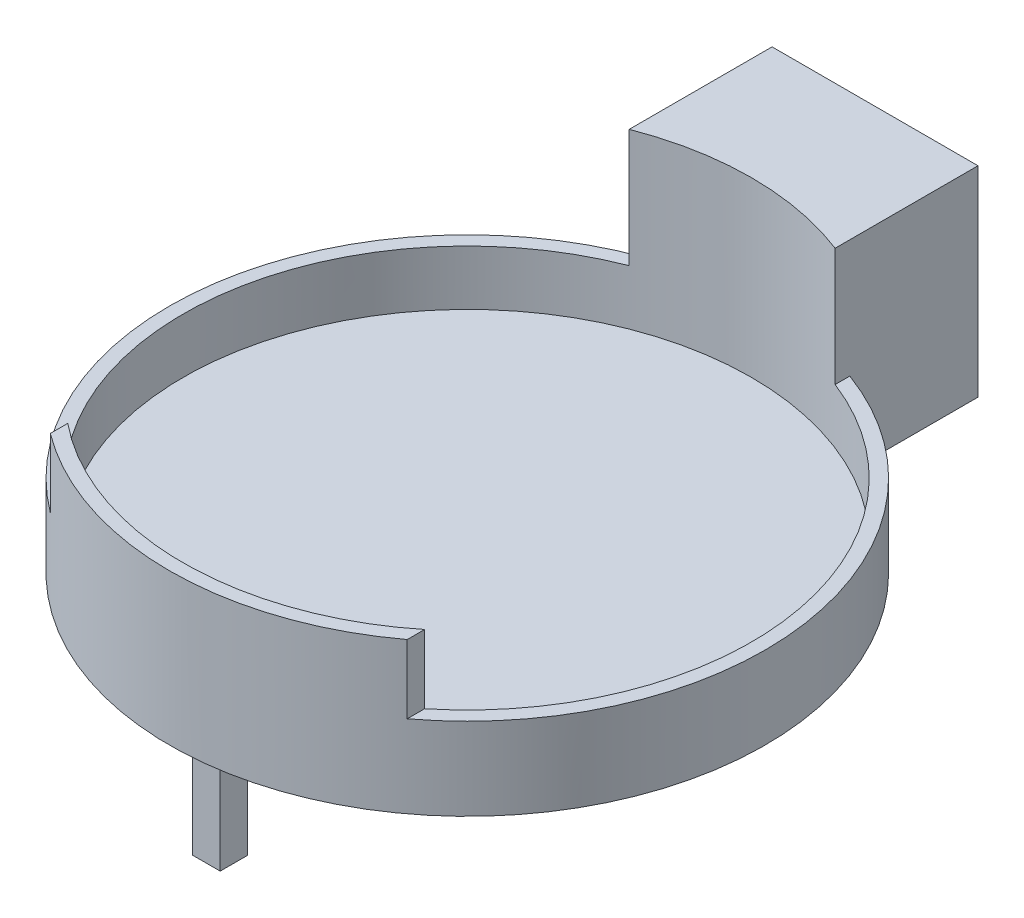
ISO-10303-21;
HEADER;
FILE_DESCRIPTION(('STEP AP214'),'2;1');
FILE_NAME('part.step','',(''),(''),'','','');
FILE_SCHEMA(('AUTOMOTIVE_DESIGN { 1 0 10303 214 1 1 1 1 }'));
ENDSEC;
DATA;
#1=APPLICATION_CONTEXT('core data for automotive mechanical design processes');
#2=APPLICATION_PROTOCOL_DEFINITION('international standard','automotive_design',2000,#1);
#3=PRODUCT_CONTEXT('',#1,'mechanical');
#4=PRODUCT('Part','Part','',(#3));
#5=PRODUCT_RELATED_PRODUCT_CATEGORY('part','',(#4));
#6=PRODUCT_DEFINITION_FORMATION('','',#4);
#7=PRODUCT_DEFINITION_CONTEXT('part definition',#1,'design');
#8=PRODUCT_DEFINITION('design','',#6,#7);
#9=PRODUCT_DEFINITION_SHAPE('','',#8);
#10=(LENGTH_UNIT() NAMED_UNIT(*) SI_UNIT(.MILLI.,.METRE.));
#11=(NAMED_UNIT(*) PLANE_ANGLE_UNIT() SI_UNIT($,.RADIAN.));
#12=(NAMED_UNIT(*) SI_UNIT($,.STERADIAN.) SOLID_ANGLE_UNIT());
#13=UNCERTAINTY_MEASURE_WITH_UNIT(LENGTH_MEASURE(1.E-05),#10,'distance_accuracy_value','');
#14=(GEOMETRIC_REPRESENTATION_CONTEXT(3) GLOBAL_UNCERTAINTY_ASSIGNED_CONTEXT((#13)) GLOBAL_UNIT_ASSIGNED_CONTEXT((#10,
#11,#12)) REPRESENTATION_CONTEXT('',''));
#15=CARTESIAN_POINT('',(0.,0.,0.));
#16=DIRECTION('',(0.,0.,1.));
#17=DIRECTION('',(1.,0.,0.));
#18=AXIS2_PLACEMENT_3D('',#15,#16,#17);
#19=CARTESIAN_POINT('',(0.,0.,0.));
#20=DIRECTION('',(0.,1.,0.));
#21=DIRECTION('',(0.,0.,1.));
#22=AXIS2_PLACEMENT_3D('',#19,#20,#21);
#23=PLANE('',#22);
#24=DIRECTION('',(0.,0.,-1.));
#25=VECTOR('',#24,1.);
#26=CARTESIAN_POINT('',(-0.5,0.,8.5));
#27=LINE('',#26,#25);
#28=CARTESIAN_POINT('',(-0.5,0.,9.5));
#29=VERTEX_POINT('',#28);
#30=CARTESIAN_POINT('',(-0.5,0.,8.5));
#31=VERTEX_POINT('',#30);
#32=EDGE_CURVE('E283',#29,#31,#27,.T.);
#33=ORIENTED_EDGE('',*,*,#32,.F.);
#34=DIRECTION('',(-1.,0.,0.));
#35=VECTOR('',#34,1.);
#36=CARTESIAN_POINT('',(0.5,0.,9.5));
#37=LINE('',#36,#35);
#38=CARTESIAN_POINT('',(0.5,0.,9.5));
#39=VERTEX_POINT('',#38);
#40=EDGE_CURVE('E288',#39,#29,#37,.T.);
#41=ORIENTED_EDGE('',*,*,#40,.F.);
#42=DIRECTION('',(0.,0.,1.));
#43=VECTOR('',#42,1.);
#44=CARTESIAN_POINT('',(0.5,0.,8.5));
#45=LINE('',#44,#43);
#46=CARTESIAN_POINT('',(0.5,0.,8.5));
#47=VERTEX_POINT('',#46);
#48=EDGE_CURVE('E300',#47,#39,#45,.T.);
#49=ORIENTED_EDGE('',*,*,#48,.F.);
#50=DIRECTION('',(1.,0.,0.));
#51=VECTOR('',#50,1.);
#52=CARTESIAN_POINT('',(0.5,0.,8.5));
#53=LINE('',#52,#51);
#54=EDGE_CURVE('E297',#31,#47,#53,.T.);
#55=ORIENTED_EDGE('',*,*,#54,.F.);
#56=EDGE_LOOP('',(#33,#41,#49,#55));
#57=FACE_BOUND('',#56,.T.);
#58=CARTESIAN_POINT('',(0.,0.,0.));
#59=DIRECTION('',(0.,1.,0.));
#60=DIRECTION('',(0.,0.,1.));
#61=AXIS2_PLACEMENT_3D('',#58,#59,#60);
#62=CIRCLE('',#61,10.85);
#63=CARTESIAN_POINT('',(-3.75,0.,-10.1813555089683));
#64=VERTEX_POINT('',#63);
#65=CARTESIAN_POINT('',(3.75,0.,-10.1813555089683));
#66=VERTEX_POINT('',#65);
#67=EDGE_CURVE('E70',#64,#66,#62,.T.);
#68=ORIENTED_EDGE('',*,*,#67,.F.);
#69=DIRECTION('',(0.,0.,-1.));
#70=VECTOR('',#69,1.);
#71=CARTESIAN_POINT('',(-3.75,0.,-10.1813555089683));
#72=LINE('',#71,#70);
#73=CARTESIAN_POINT('',(-3.75,0.,-14.85));
#74=VERTEX_POINT('',#73);
#75=EDGE_CURVE('E341',#64,#74,#72,.T.);
#76=ORIENTED_EDGE('',*,*,#75,.T.);
#77=DIRECTION('',(1.,0.,0.));
#78=VECTOR('',#77,1.);
#79=CARTESIAN_POINT('',(-3.75,0.,-14.85));
#80=LINE('',#79,#78);
#81=CARTESIAN_POINT('',(3.75,0.,-14.85));
#82=VERTEX_POINT('',#81);
#83=EDGE_CURVE('E197',#74,#82,#80,.T.);
#84=ORIENTED_EDGE('',*,*,#83,.T.);
#85=DIRECTION('',(0.,0.,1.));
#86=VECTOR('',#85,1.);
#87=CARTESIAN_POINT('',(3.75,0.,-14.85));
#88=LINE('',#87,#86);
#89=EDGE_CURVE('E199',#82,#66,#88,.T.);
#90=ORIENTED_EDGE('',*,*,#89,.T.);
#91=EDGE_LOOP('',(#68,#76,#84,#90));
#92=FACE_BOUND('',#91,.T.);
#93=DIRECTION('',(0.,0.,1.));
#94=VECTOR('',#93,1.);
#95=CARTESIAN_POINT('',(0.5,0.,-8.5));
#96=LINE('',#95,#94);
#97=CARTESIAN_POINT('',(0.5,0.,-9.5));
#98=VERTEX_POINT('',#97);
#99=CARTESIAN_POINT('',(0.5,0.,-8.5));
#100=VERTEX_POINT('',#99);
#101=EDGE_CURVE('E250',#98,#100,#96,.T.);
#102=ORIENTED_EDGE('',*,*,#101,.F.);
#103=DIRECTION('',(1.,0.,0.));
#104=VECTOR('',#103,1.);
#105=CARTESIAN_POINT('',(-0.5,0.,-9.5));
#106=LINE('',#105,#104);
#107=CARTESIAN_POINT('',(-0.5,0.,-9.5));
#108=VERTEX_POINT('',#107);
#109=EDGE_CURVE('E255',#108,#98,#106,.T.);
#110=ORIENTED_EDGE('',*,*,#109,.F.);
#111=DIRECTION('',(0.,0.,-1.));
#112=VECTOR('',#111,1.);
#113=CARTESIAN_POINT('',(-0.5,0.,-8.5));
#114=LINE('',#113,#112);
#115=CARTESIAN_POINT('',(-0.5,0.,-8.5));
#116=VERTEX_POINT('',#115);
#117=EDGE_CURVE('E267',#116,#108,#114,.T.);
#118=ORIENTED_EDGE('',*,*,#117,.F.);
#119=DIRECTION('',(-1.,0.,0.));
#120=VECTOR('',#119,1.);
#121=CARTESIAN_POINT('',(-0.5,0.,-8.5));
#122=LINE('',#121,#120);
#123=EDGE_CURVE('E264',#100,#116,#122,.T.);
#124=ORIENTED_EDGE('',*,*,#123,.F.);
#125=EDGE_LOOP('',(#102,#110,#118,#124));
#126=FACE_BOUND('',#125,.T.);
#127=ADVANCED_FACE('F51',(#57,#92,#126),#23,.F.);
#128=CARTESIAN_POINT('',(0.,1.,0.));
#129=DIRECTION('',(0.,-1.,0.));
#130=DIRECTION('',(0.,0.,-1.));
#131=AXIS2_PLACEMENT_3D('',#128,#129,#130);
#132=CYLINDRICAL_SURFACE('',#131,10.85);
#133=CARTESIAN_POINT('',(0.,3.,0.));
#134=DIRECTION('',(0.,1.,0.));
#135=DIRECTION('',(0.,0.,1.));
#136=AXIS2_PLACEMENT_3D('',#133,#134,#135);
#137=CIRCLE('',#136,10.85);
#138=CARTESIAN_POINT('',(-6.5,3.,8.68749100718959));
#139=VERTEX_POINT('',#138);
#140=CARTESIAN_POINT('',(-3.75,3.,-10.1813555089683));
#141=VERTEX_POINT('',#140);
#142=EDGE_CURVE('E215',#139,#141,#137,.F.);
#143=ORIENTED_EDGE('',*,*,#142,.T.);
#144=DIRECTION('',(0.,-1.,0.));
#145=VECTOR('',#144,1.);
#146=CARTESIAN_POINT('',(-3.75,16.1343783812807,-10.1813555089683));
#147=LINE('',#146,#145);
#148=EDGE_CURVE('E66',#141,#64,#147,.T.);
#149=ORIENTED_EDGE('',*,*,#148,.T.);
#150=ORIENTED_EDGE('',*,*,#67,.T.);
#151=DIRECTION('',(0.,-1.,0.));
#152=VECTOR('',#151,1.);
#153=CARTESIAN_POINT('',(3.75,16.1343783812807,-10.1813555089683));
#154=LINE('',#153,#152);
#155=CARTESIAN_POINT('',(3.75,3.,-10.1813555089683));
#156=VERTEX_POINT('',#155);
#157=EDGE_CURVE('E208',#156,#66,#154,.T.);
#158=ORIENTED_EDGE('',*,*,#157,.F.);
#159=CARTESIAN_POINT('',(0.,3.,0.));
#160=DIRECTION('',(0.,1.,0.));
#161=DIRECTION('',(0.,0.,1.));
#162=AXIS2_PLACEMENT_3D('',#159,#160,#161);
#163=CIRCLE('',#162,10.85);
#164=CARTESIAN_POINT('',(6.5,3.,8.68749100718959));
#165=VERTEX_POINT('',#164);
#166=EDGE_CURVE('E229',#156,#165,#163,.F.);
#167=ORIENTED_EDGE('',*,*,#166,.T.);
#168=DIRECTION('',(0.,1.,0.));
#169=VECTOR('',#168,1.);
#170=CARTESIAN_POINT('',(6.5,-19.1604406908759,8.68749100718959));
#171=LINE('',#170,#169);
#172=CARTESIAN_POINT('',(6.5,5.5,8.68749100718959));
#173=VERTEX_POINT('',#172);
#174=EDGE_CURVE('E226',#165,#173,#171,.T.);
#175=ORIENTED_EDGE('',*,*,#174,.T.);
#176=CARTESIAN_POINT('',(0.,5.5,0.));
#177=DIRECTION('',(0.,1.,0.));
#178=DIRECTION('',(0.,0.,1.));
#179=AXIS2_PLACEMENT_3D('',#176,#177,#178);
#180=CIRCLE('',#179,10.85);
#181=CARTESIAN_POINT('',(-6.5,5.5,8.68749100718959));
#182=VERTEX_POINT('',#181);
#183=EDGE_CURVE('E237',#173,#182,#180,.F.);
#184=ORIENTED_EDGE('',*,*,#183,.T.);
#185=DIRECTION('',(0.,1.,0.));
#186=VECTOR('',#185,1.);
#187=CARTESIAN_POINT('',(-6.5,-19.1604406908759,8.68749100718959));
#188=LINE('',#187,#186);
#189=EDGE_CURVE('E219',#139,#182,#188,.T.);
#190=ORIENTED_EDGE('',*,*,#189,.F.);
#191=EDGE_LOOP('',(#143,#149,#150,#158,#167,#175,#184,#190));
#192=FACE_BOUND('',#191,.T.);
#193=ADVANCED_FACE('F53',(#192),#132,.T.);
#194=CARTESIAN_POINT('',(-0.5,-4.4,8.5));
#195=DIRECTION('',(1.,0.,0.));
#196=DIRECTION('',(0.,0.,-1.));
#197=AXIS2_PLACEMENT_3D('',#194,#195,#196);
#198=PLANE('',#197);
#199=ORIENTED_EDGE('',*,*,#32,.T.);
#200=DIRECTION('',(0.,1.,0.));
#201=VECTOR('',#200,1.);
#202=CARTESIAN_POINT('',(-0.5,-4.4,8.5));
#203=LINE('',#202,#201);
#204=CARTESIAN_POINT('',(-0.5,-4.4,8.5));
#205=VERTEX_POINT('',#204);
#206=EDGE_CURVE('E313',#205,#31,#203,.T.);
#207=ORIENTED_EDGE('',*,*,#206,.F.);
#208=DIRECTION('',(0.,0.,-1.));
#209=VECTOR('',#208,1.);
#210=CARTESIAN_POINT('',(-0.5,-4.4,8.5));
#211=LINE('',#210,#209);
#212=CARTESIAN_POINT('',(-0.5,-4.4,9.5));
#213=VERTEX_POINT('',#212);
#214=EDGE_CURVE('E284',#213,#205,#211,.T.);
#215=ORIENTED_EDGE('',*,*,#214,.F.);
#216=DIRECTION('',(0.,1.,0.));
#217=VECTOR('',#216,1.);
#218=CARTESIAN_POINT('',(-0.5,-4.4,9.5));
#219=LINE('',#218,#217);
#220=EDGE_CURVE('E294',#213,#29,#219,.T.);
#221=ORIENTED_EDGE('',*,*,#220,.T.);
#222=EDGE_LOOP('',(#199,#207,#215,#221));
#223=FACE_BOUND('',#222,.T.);
#224=ADVANCED_FACE('F366',(#223),#198,.F.);
#225=CARTESIAN_POINT('',(0.5,-4.4,8.5));
#226=DIRECTION('',(0.,0.,1.));
#227=DIRECTION('',(1.,0.,0.));
#228=AXIS2_PLACEMENT_3D('',#225,#226,#227);
#229=PLANE('',#228);
#230=ORIENTED_EDGE('',*,*,#54,.T.);
#231=DIRECTION('',(0.,1.,0.));
#232=VECTOR('',#231,1.);
#233=CARTESIAN_POINT('',(0.5,-4.4,8.5));
#234=LINE('',#233,#232);
#235=CARTESIAN_POINT('',(0.5,-4.4,8.5));
#236=VERTEX_POINT('',#235);
#237=EDGE_CURVE('E310',#236,#47,#234,.T.);
#238=ORIENTED_EDGE('',*,*,#237,.F.);
#239=DIRECTION('',(1.,0.,0.));
#240=VECTOR('',#239,1.);
#241=CARTESIAN_POINT('',(0.5,-4.4,8.5));
#242=LINE('',#241,#240);
#243=EDGE_CURVE('E287',#205,#236,#242,.T.);
#244=ORIENTED_EDGE('',*,*,#243,.F.);
#245=ORIENTED_EDGE('',*,*,#206,.T.);
#246=EDGE_LOOP('',(#230,#238,#244,#245));
#247=FACE_BOUND('',#246,.T.);
#248=ADVANCED_FACE('F370',(#247),#229,.F.);
#249=CARTESIAN_POINT('',(0.5,-4.4,8.5));
#250=DIRECTION('',(-1.,0.,0.));
#251=DIRECTION('',(0.,0.,1.));
#252=AXIS2_PLACEMENT_3D('',#249,#250,#251);
#253=PLANE('',#252);
#254=ORIENTED_EDGE('',*,*,#48,.T.);
#255=DIRECTION('',(0.,1.,0.));
#256=VECTOR('',#255,1.);
#257=CARTESIAN_POINT('',(0.5,-4.4,9.5));
#258=LINE('',#257,#256);
#259=CARTESIAN_POINT('',(0.5,-4.4,9.5));
#260=VERTEX_POINT('',#259);
#261=EDGE_CURVE('E307',#260,#39,#258,.T.);
#262=ORIENTED_EDGE('',*,*,#261,.F.);
#263=DIRECTION('',(0.,0.,1.));
#264=VECTOR('',#263,1.);
#265=CARTESIAN_POINT('',(0.5,-4.4,8.5));
#266=LINE('',#265,#264);
#267=EDGE_CURVE('E290',#236,#260,#266,.T.);
#268=ORIENTED_EDGE('',*,*,#267,.F.);
#269=ORIENTED_EDGE('',*,*,#237,.T.);
#270=EDGE_LOOP('',(#254,#262,#268,#269));
#271=FACE_BOUND('',#270,.T.);
#272=ADVANCED_FACE('F374',(#271),#253,.F.);
#273=CARTESIAN_POINT('',(0.5,-4.4,9.5));
#274=DIRECTION('',(0.,0.,-1.));
#275=DIRECTION('',(-1.,0.,0.));
#276=AXIS2_PLACEMENT_3D('',#273,#274,#275);
#277=PLANE('',#276);
#278=ORIENTED_EDGE('',*,*,#40,.T.);
#279=ORIENTED_EDGE('',*,*,#220,.F.);
#280=DIRECTION('',(-1.,0.,0.));
#281=VECTOR('',#280,1.);
#282=CARTESIAN_POINT('',(0.5,-4.4,9.5));
#283=LINE('',#282,#281);
#284=EDGE_CURVE('E292',#260,#213,#283,.T.);
#285=ORIENTED_EDGE('',*,*,#284,.F.);
#286=ORIENTED_EDGE('',*,*,#261,.T.);
#287=EDGE_LOOP('',(#278,#279,#285,#286));
#288=FACE_BOUND('',#287,.T.);
#289=ADVANCED_FACE('F378',(#288),#277,.F.);
#290=CARTESIAN_POINT('',(0.,-4.4,0.));
#291=DIRECTION('',(0.,-1.,0.));
#292=DIRECTION('',(0.,0.,-1.));
#293=AXIS2_PLACEMENT_3D('',#290,#291,#292);
#294=PLANE('',#293);
#295=ORIENTED_EDGE('',*,*,#214,.T.);
#296=ORIENTED_EDGE('',*,*,#243,.T.);
#297=ORIENTED_EDGE('',*,*,#267,.T.);
#298=ORIENTED_EDGE('',*,*,#284,.T.);
#299=EDGE_LOOP('',(#295,#296,#297,#298));
#300=FACE_BOUND('',#299,.T.);
#301=ADVANCED_FACE('F382',(#300),#294,.T.);
#302=CARTESIAN_POINT('',(0.5,-4.4,-8.5));
#303=DIRECTION('',(-1.,0.,0.));
#304=DIRECTION('',(0.,0.,1.));
#305=AXIS2_PLACEMENT_3D('',#302,#303,#304);
#306=PLANE('',#305);
#307=ORIENTED_EDGE('',*,*,#101,.T.);
#308=DIRECTION('',(0.,1.,0.));
#309=VECTOR('',#308,1.);
#310=CARTESIAN_POINT('',(0.5,-4.4,-8.5));
#311=LINE('',#310,#309);
#312=CARTESIAN_POINT('',(0.5,-4.4,-8.5));
#313=VERTEX_POINT('',#312);
#314=EDGE_CURVE('E280',#313,#100,#311,.T.);
#315=ORIENTED_EDGE('',*,*,#314,.F.);
#316=DIRECTION('',(0.,0.,1.));
#317=VECTOR('',#316,1.);
#318=CARTESIAN_POINT('',(0.5,-4.4,-8.5));
#319=LINE('',#318,#317);
#320=CARTESIAN_POINT('',(0.5,-4.4,-9.5));
#321=VERTEX_POINT('',#320);
#322=EDGE_CURVE('E251',#321,#313,#319,.T.);
#323=ORIENTED_EDGE('',*,*,#322,.F.);
#324=DIRECTION('',(0.,1.,0.));
#325=VECTOR('',#324,1.);
#326=CARTESIAN_POINT('',(0.5,-4.4,-9.5));
#327=LINE('',#326,#325);
#328=EDGE_CURVE('E261',#321,#98,#327,.T.);
#329=ORIENTED_EDGE('',*,*,#328,.T.);
#330=EDGE_LOOP('',(#307,#315,#323,#329));
#331=FACE_BOUND('',#330,.T.);
#332=ADVANCED_FACE('F386',(#331),#306,.F.);
#333=CARTESIAN_POINT('',(-0.5,-4.4,-8.5));
#334=DIRECTION('',(0.,0.,-1.));
#335=DIRECTION('',(-1.,0.,0.));
#336=AXIS2_PLACEMENT_3D('',#333,#334,#335);
#337=PLANE('',#336);
#338=ORIENTED_EDGE('',*,*,#123,.T.);
#339=DIRECTION('',(0.,1.,0.));
#340=VECTOR('',#339,1.);
#341=CARTESIAN_POINT('',(-0.5,-4.4,-8.5));
#342=LINE('',#341,#340);
#343=CARTESIAN_POINT('',(-0.5,-4.4,-8.5));
#344=VERTEX_POINT('',#343);
#345=EDGE_CURVE('E277',#344,#116,#342,.T.);
#346=ORIENTED_EDGE('',*,*,#345,.F.);
#347=DIRECTION('',(-1.,0.,0.));
#348=VECTOR('',#347,1.);
#349=CARTESIAN_POINT('',(-0.5,-4.4,-8.5));
#350=LINE('',#349,#348);
#351=EDGE_CURVE('E254',#313,#344,#350,.T.);
#352=ORIENTED_EDGE('',*,*,#351,.F.);
#353=ORIENTED_EDGE('',*,*,#314,.T.);
#354=EDGE_LOOP('',(#338,#346,#352,#353));
#355=FACE_BOUND('',#354,.T.);
#356=ADVANCED_FACE('F390',(#355),#337,.F.);
#357=CARTESIAN_POINT('',(-0.5,-4.4,-8.5));
#358=DIRECTION('',(1.,0.,0.));
#359=DIRECTION('',(0.,0.,-1.));
#360=AXIS2_PLACEMENT_3D('',#357,#358,#359);
#361=PLANE('',#360);
#362=ORIENTED_EDGE('',*,*,#117,.T.);
#363=DIRECTION('',(0.,1.,0.));
#364=VECTOR('',#363,1.);
#365=CARTESIAN_POINT('',(-0.5,-4.4,-9.5));
#366=LINE('',#365,#364);
#367=CARTESIAN_POINT('',(-0.5,-4.4,-9.5));
#368=VERTEX_POINT('',#367);
#369=EDGE_CURVE('E274',#368,#108,#366,.T.);
#370=ORIENTED_EDGE('',*,*,#369,.F.);
#371=DIRECTION('',(0.,0.,-1.));
#372=VECTOR('',#371,1.);
#373=CARTESIAN_POINT('',(-0.5,-4.4,-8.5));
#374=LINE('',#373,#372);
#375=EDGE_CURVE('E257',#344,#368,#374,.T.);
#376=ORIENTED_EDGE('',*,*,#375,.F.);
#377=ORIENTED_EDGE('',*,*,#345,.T.);
#378=EDGE_LOOP('',(#362,#370,#376,#377));
#379=FACE_BOUND('',#378,.T.);
#380=ADVANCED_FACE('F394',(#379),#361,.F.);
#381=CARTESIAN_POINT('',(-0.5,-4.4,-9.5));
#382=DIRECTION('',(0.,0.,1.));
#383=DIRECTION('',(1.,0.,0.));
#384=AXIS2_PLACEMENT_3D('',#381,#382,#383);
#385=PLANE('',#384);
#386=ORIENTED_EDGE('',*,*,#109,.T.);
#387=ORIENTED_EDGE('',*,*,#328,.F.);
#388=DIRECTION('',(1.,0.,0.));
#389=VECTOR('',#388,1.);
#390=CARTESIAN_POINT('',(-0.5,-4.4,-9.5));
#391=LINE('',#390,#389);
#392=EDGE_CURVE('E259',#368,#321,#391,.T.);
#393=ORIENTED_EDGE('',*,*,#392,.F.);
#394=ORIENTED_EDGE('',*,*,#369,.T.);
#395=EDGE_LOOP('',(#386,#387,#393,#394));
#396=FACE_BOUND('',#395,.T.);
#397=ADVANCED_FACE('F398',(#396),#385,.F.);
#398=CARTESIAN_POINT('',(0.,-4.4,0.));
#399=DIRECTION('',(0.,-1.,0.));
#400=DIRECTION('',(0.,0.,1.));
#401=AXIS2_PLACEMENT_3D('',#398,#399,#400);
#402=PLANE('',#401);
#403=ORIENTED_EDGE('',*,*,#322,.T.);
#404=ORIENTED_EDGE('',*,*,#351,.T.);
#405=ORIENTED_EDGE('',*,*,#375,.T.);
#406=ORIENTED_EDGE('',*,*,#392,.T.);
#407=EDGE_LOOP('',(#403,#404,#405,#406));
#408=FACE_BOUND('',#407,.T.);
#409=ADVANCED_FACE('F402',(#408),#402,.T.);
#410=CARTESIAN_POINT('',(0.,7.3,0.));
#411=DIRECTION('',(0.,1.,0.));
#412=DIRECTION('',(0.,0.,1.));
#413=AXIS2_PLACEMENT_3D('',#410,#411,#412);
#414=PLANE('',#413);
#415=DIRECTION('',(0.,0.,1.));
#416=VECTOR('',#415,1.);
#417=CARTESIAN_POINT('',(3.75,7.3,-9.64676111448811));
#418=LINE('',#417,#416);
#419=CARTESIAN_POINT('',(3.75,7.3,-14.85));
#420=VERTEX_POINT('',#419);
#421=CARTESIAN_POINT('',(3.75,7.3,-9.64676111448811));
#422=VERTEX_POINT('',#421);
#423=EDGE_CURVE('E185',#420,#422,#418,.T.);
#424=ORIENTED_EDGE('',*,*,#423,.F.);
#425=DIRECTION('',(1.,0.,0.));
#426=VECTOR('',#425,1.);
#427=CARTESIAN_POINT('',(-3.75,7.3,-14.85));
#428=LINE('',#427,#426);
#429=CARTESIAN_POINT('',(-3.75,7.3,-14.85));
#430=VERTEX_POINT('',#429);
#431=EDGE_CURVE('E189',#430,#420,#428,.T.);
#432=ORIENTED_EDGE('',*,*,#431,.F.);
#433=DIRECTION('',(0.,0.,-1.));
#434=VECTOR('',#433,1.);
#435=CARTESIAN_POINT('',(-3.75,7.3,-9.64676111448811));
#436=LINE('',#435,#434);
#437=CARTESIAN_POINT('',(-3.75,7.3,-9.64676111448811));
#438=VERTEX_POINT('',#437);
#439=EDGE_CURVE('E173',#438,#430,#436,.T.);
#440=ORIENTED_EDGE('',*,*,#439,.F.);
#441=CARTESIAN_POINT('',(0.,7.3,0.));
#442=DIRECTION('',(0.,1.,0.));
#443=DIRECTION('',(0.,0.,1.));
#444=AXIS2_PLACEMENT_3D('',#441,#442,#443);
#445=CIRCLE('',#444,10.35);
#446=EDGE_CURVE('E243',#422,#438,#445,.T.);
#447=ORIENTED_EDGE('',*,*,#446,.F.);
#448=EDGE_LOOP('',(#424,#432,#440,#447));
#449=FACE_BOUND('',#448,.T.);
#450=ADVANCED_FACE('F190',(#449),#414,.T.);
#451=CARTESIAN_POINT('',(0.,7.3,0.));
#452=DIRECTION('',(0.,-1.,0.));
#453=DIRECTION('',(0.,0.,-1.));
#454=AXIS2_PLACEMENT_3D('',#451,#452,#453);
#455=CYLINDRICAL_SURFACE('',#454,10.35);
#456=DIRECTION('',(0.,1.,0.));
#457=VECTOR('',#456,1.);
#458=CARTESIAN_POINT('',(-3.75,-29.2193301471858,-9.64676111448811));
#459=LINE('',#458,#457);
#460=CARTESIAN_POINT('',(-3.74999999999999,3.,-9.64676111448812));
#461=VERTEX_POINT('',#460);
#462=EDGE_CURVE('E181',#461,#438,#459,.T.);
#463=ORIENTED_EDGE('',*,*,#462,.F.);
#464=CARTESIAN_POINT('',(0.,3.,0.));
#465=DIRECTION('',(0.,1.,0.));
#466=DIRECTION('',(0.,0.,1.));
#467=AXIS2_PLACEMENT_3D('',#464,#465,#466);
#468=CIRCLE('',#467,10.35);
#469=CARTESIAN_POINT('',(-6.5,3.,8.05434665258455));
#470=VERTEX_POINT('',#469);
#471=EDGE_CURVE('E209',#461,#470,#468,.T.);
#472=ORIENTED_EDGE('',*,*,#471,.T.);
#473=DIRECTION('',(0.,1.,0.));
#474=VECTOR('',#473,1.);
#475=CARTESIAN_POINT('',(-6.5,-19.1604406908759,8.05434665258455));
#476=LINE('',#475,#474);
#477=CARTESIAN_POINT('',(-6.5,5.5,8.05434665258455));
#478=VERTEX_POINT('',#477);
#479=EDGE_CURVE('E213',#470,#478,#476,.T.);
#480=ORIENTED_EDGE('',*,*,#479,.T.);
#481=CARTESIAN_POINT('',(0.,5.5,0.));
#482=DIRECTION('',(0.,1.,0.));
#483=DIRECTION('',(0.,0.,1.));
#484=AXIS2_PLACEMENT_3D('',#481,#482,#483);
#485=CIRCLE('',#484,10.35);
#486=CARTESIAN_POINT('',(6.5,5.5,8.05434665258455));
#487=VERTEX_POINT('',#486);
#488=EDGE_CURVE('E240',#478,#487,#485,.T.);
#489=ORIENTED_EDGE('',*,*,#488,.T.);
#490=DIRECTION('',(0.,1.,0.));
#491=VECTOR('',#490,1.);
#492=CARTESIAN_POINT('',(6.5,-19.1604406908759,8.05434665258455));
#493=LINE('',#492,#491);
#494=CARTESIAN_POINT('',(6.5,3.,8.05434665258455));
#495=VERTEX_POINT('',#494);
#496=EDGE_CURVE('E221',#495,#487,#493,.T.);
#497=ORIENTED_EDGE('',*,*,#496,.F.);
#498=CARTESIAN_POINT('',(0.,3.,0.));
#499=DIRECTION('',(0.,1.,0.));
#500=DIRECTION('',(0.,0.,1.));
#501=AXIS2_PLACEMENT_3D('',#498,#499,#500);
#502=CIRCLE('',#501,10.35);
#503=CARTESIAN_POINT('',(3.75,3.,-9.64676111448811));
#504=VERTEX_POINT('',#503);
#505=EDGE_CURVE('E224',#495,#504,#502,.T.);
#506=ORIENTED_EDGE('',*,*,#505,.T.);
#507=DIRECTION('',(0.,1.,0.));
#508=VECTOR('',#507,1.);
#509=CARTESIAN_POINT('',(3.75,-29.2193301471858,-9.64676111448811));
#510=LINE('',#509,#508);
#511=EDGE_CURVE('E241',#504,#422,#510,.T.);
#512=ORIENTED_EDGE('',*,*,#511,.T.);
#513=ORIENTED_EDGE('',*,*,#446,.T.);
#514=EDGE_LOOP('',(#463,#472,#480,#489,#497,#506,#512,#513));
#515=FACE_BOUND('',#514,.T.);
#516=CARTESIAN_POINT('',(0.,1.,0.));
#517=DIRECTION('',(0.,1.,0.));
#518=DIRECTION('',(0.,0.,1.));
#519=AXIS2_PLACEMENT_3D('',#516,#517,#518);
#520=CIRCLE('',#519,10.35);
#521=CARTESIAN_POINT('',(0.,1.,10.35));
#522=VERTEX_POINT('',#521);
#523=EDGE_CURVE('E317',#522,#522,#520,.F.);
#524=ORIENTED_EDGE('',*,*,#523,.T.);
#525=EDGE_LOOP('',(#524));
#526=FACE_BOUND('',#525,.T.);
#527=ADVANCED_FACE('F335',(#515,#526),#455,.F.);
#528=CARTESIAN_POINT('',(0.,1.,0.));
#529=DIRECTION('',(0.,1.,0.));
#530=DIRECTION('',(0.,0.,1.));
#531=AXIS2_PLACEMENT_3D('',#528,#529,#530);
#532=PLANE('',#531);
#533=ORIENTED_EDGE('',*,*,#523,.F.);
#534=EDGE_LOOP('',(#533));
#535=FACE_BOUND('',#534,.T.);
#536=ADVANCED_FACE('F351',(#535),#532,.T.);
#537=CARTESIAN_POINT('',(3.75,-29.2193301471858,-9.64676111448811));
#538=DIRECTION('',(-1.,0.,0.));
#539=DIRECTION('',(0.,0.,1.));
#540=AXIS2_PLACEMENT_3D('',#537,#538,#539);
#541=PLANE('',#540);
#542=ORIENTED_EDGE('',*,*,#511,.F.);
#543=DIRECTION('',(0.,0.,-1.));
#544=VECTOR('',#543,1.);
#545=CARTESIAN_POINT('',(3.75,3.,-10.1813555089683));
#546=LINE('',#545,#544);
#547=EDGE_CURVE('E232',#504,#156,#546,.T.);
#548=ORIENTED_EDGE('',*,*,#547,.T.);
#549=ORIENTED_EDGE('',*,*,#157,.T.);
#550=ORIENTED_EDGE('',*,*,#89,.F.);
#551=DIRECTION('',(0.,-1.,0.));
#552=VECTOR('',#551,1.);
#553=CARTESIAN_POINT('',(3.75,16.1343783812807,-14.85));
#554=LINE('',#553,#552);
#555=EDGE_CURVE('E193',#420,#82,#554,.T.);
#556=ORIENTED_EDGE('',*,*,#555,.F.);
#557=ORIENTED_EDGE('',*,*,#423,.T.);
#558=EDGE_LOOP('',(#542,#548,#549,#550,#556,#557));
#559=FACE_BOUND('',#558,.T.);
#560=ADVANCED_FACE('F348',(#559),#541,.F.);
#561=CARTESIAN_POINT('',(-3.75,-29.2193301471858,-9.64676111448811));
#562=DIRECTION('',(1.,0.,0.));
#563=DIRECTION('',(0.,0.,-1.));
#564=AXIS2_PLACEMENT_3D('',#561,#562,#563);
#565=PLANE('',#564);
#566=ORIENTED_EDGE('',*,*,#439,.T.);
#567=DIRECTION('',(0.,-1.,0.));
#568=VECTOR('',#567,1.);
#569=CARTESIAN_POINT('',(-3.75,16.1343783812807,-14.85));
#570=LINE('',#569,#568);
#571=EDGE_CURVE('E178',#430,#74,#570,.T.);
#572=ORIENTED_EDGE('',*,*,#571,.T.);
#573=ORIENTED_EDGE('',*,*,#75,.F.);
#574=ORIENTED_EDGE('',*,*,#148,.F.);
#575=DIRECTION('',(0.,0.,1.));
#576=VECTOR('',#575,1.);
#577=CARTESIAN_POINT('',(-3.75,3.,-9.64676111448811));
#578=LINE('',#577,#576);
#579=EDGE_CURVE('E212',#141,#461,#578,.T.);
#580=ORIENTED_EDGE('',*,*,#579,.T.);
#581=ORIENTED_EDGE('',*,*,#462,.T.);
#582=EDGE_LOOP('',(#566,#572,#573,#574,#580,#581));
#583=FACE_BOUND('',#582,.T.);
#584=ADVANCED_FACE('F175',(#583),#565,.F.);
#585=CARTESIAN_POINT('',(0.,5.5,0.));
#586=DIRECTION('',(0.,1.,0.));
#587=DIRECTION('',(0.,0.,1.));
#588=AXIS2_PLACEMENT_3D('',#585,#586,#587);
#589=PLANE('',#588);
#590=DIRECTION('',(0.,0.,-1.));
#591=VECTOR('',#590,1.);
#592=CARTESIAN_POINT('',(-6.5,5.5,0.));
#593=LINE('',#592,#591);
#594=EDGE_CURVE('E13',#182,#478,#593,.T.);
#595=ORIENTED_EDGE('',*,*,#594,.F.);
#596=ORIENTED_EDGE('',*,*,#183,.F.);
#597=DIRECTION('',(0.,0.,1.));
#598=VECTOR('',#597,1.);
#599=CARTESIAN_POINT('',(6.5,5.5,0.));
#600=LINE('',#599,#598);
#601=EDGE_CURVE('E59',#487,#173,#600,.T.);
#602=ORIENTED_EDGE('',*,*,#601,.F.);
#603=ORIENTED_EDGE('',*,*,#488,.F.);
#604=EDGE_LOOP('',(#595,#596,#602,#603));
#605=FACE_BOUND('',#604,.T.);
#606=ADVANCED_FACE('F330',(#605),#589,.T.);
#607=CARTESIAN_POINT('',(6.5,-19.1604406908759,8.68749100718959));
#608=DIRECTION('',(-1.,0.,0.));
#609=DIRECTION('',(0.,0.,1.));
#610=AXIS2_PLACEMENT_3D('',#607,#608,#609);
#611=PLANE('',#610);
#612=ORIENTED_EDGE('',*,*,#601,.T.);
#613=ORIENTED_EDGE('',*,*,#174,.F.);
#614=DIRECTION('',(0.,0.,-1.));
#615=VECTOR('',#614,1.);
#616=CARTESIAN_POINT('',(6.5,3.,8.68749100718959));
#617=LINE('',#616,#615);
#618=EDGE_CURVE('E207',#165,#495,#617,.T.);
#619=ORIENTED_EDGE('',*,*,#618,.T.);
#620=ORIENTED_EDGE('',*,*,#496,.T.);
#621=EDGE_LOOP('',(#612,#613,#619,#620));
#622=FACE_BOUND('',#621,.T.);
#623=ADVANCED_FACE('F321',(#622),#611,.F.);
#624=CARTESIAN_POINT('',(0.,3.,0.));
#625=DIRECTION('',(0.,1.,0.));
#626=DIRECTION('',(0.,0.,1.));
#627=AXIS2_PLACEMENT_3D('',#624,#625,#626);
#628=PLANE('',#627);
#629=ORIENTED_EDGE('',*,*,#505,.F.);
#630=ORIENTED_EDGE('',*,*,#618,.F.);
#631=ORIENTED_EDGE('',*,*,#166,.F.);
#632=ORIENTED_EDGE('',*,*,#547,.F.);
#633=EDGE_LOOP('',(#629,#630,#631,#632));
#634=FACE_BOUND('',#633,.T.);
#635=ADVANCED_FACE('F447',(#634),#628,.T.);
#636=CARTESIAN_POINT('',(-6.5,-19.1604406908759,8.68749100718959));
#637=DIRECTION('',(1.,0.,0.));
#638=DIRECTION('',(0.,0.,-1.));
#639=AXIS2_PLACEMENT_3D('',#636,#637,#638);
#640=PLANE('',#639);
#641=ORIENTED_EDGE('',*,*,#594,.T.);
#642=ORIENTED_EDGE('',*,*,#479,.F.);
#643=DIRECTION('',(0.,0.,1.));
#644=VECTOR('',#643,1.);
#645=CARTESIAN_POINT('',(-6.5,3.,8.68749100718959));
#646=LINE('',#645,#644);
#647=EDGE_CURVE('E186',#470,#139,#646,.T.);
#648=ORIENTED_EDGE('',*,*,#647,.T.);
#649=ORIENTED_EDGE('',*,*,#189,.T.);
#650=EDGE_LOOP('',(#641,#642,#648,#649));
#651=FACE_BOUND('',#650,.T.);
#652=ADVANCED_FACE('F332',(#651),#640,.F.);
#653=CARTESIAN_POINT('',(0.,3.,0.));
#654=DIRECTION('',(0.,1.,0.));
#655=DIRECTION('',(0.,0.,1.));
#656=AXIS2_PLACEMENT_3D('',#653,#654,#655);
#657=PLANE('',#656);
#658=ORIENTED_EDGE('',*,*,#142,.F.);
#659=ORIENTED_EDGE('',*,*,#647,.F.);
#660=ORIENTED_EDGE('',*,*,#471,.F.);
#661=ORIENTED_EDGE('',*,*,#579,.F.);
#662=EDGE_LOOP('',(#658,#659,#660,#661));
#663=FACE_BOUND('',#662,.T.);
#664=ADVANCED_FACE('F340',(#663),#657,.T.);
#665=CARTESIAN_POINT('',(-3.75,16.1343783812807,-14.85));
#666=DIRECTION('',(0.,0.,-1.));
#667=DIRECTION('',(-1.,0.,0.));
#668=AXIS2_PLACEMENT_3D('',#665,#666,#667);
#669=PLANE('',#668);
#670=ORIENTED_EDGE('',*,*,#571,.F.);
#671=ORIENTED_EDGE('',*,*,#431,.T.);
#672=ORIENTED_EDGE('',*,*,#555,.T.);
#673=ORIENTED_EDGE('',*,*,#83,.F.);
#674=EDGE_LOOP('',(#670,#671,#672,#673));
#675=FACE_BOUND('',#674,.T.);
#676=ADVANCED_FACE('F195',(#675),#669,.T.);
#677=CLOSED_SHELL('',(#127,#193,#224,#248,#272,#289,#301,#332,#356,#380,#397,#409,#450,#527,
#536,#560,#584,#606,#623,#635,#652,#664,#676));
#678=MANIFOLD_SOLID_BREP('B2',#677);
#679=ADVANCED_BREP_SHAPE_REPRESENTATION('',(#18,#678),#14);
#680=SHAPE_DEFINITION_REPRESENTATION(#9,#679);
ENDSEC;
END-ISO-10303-21;
